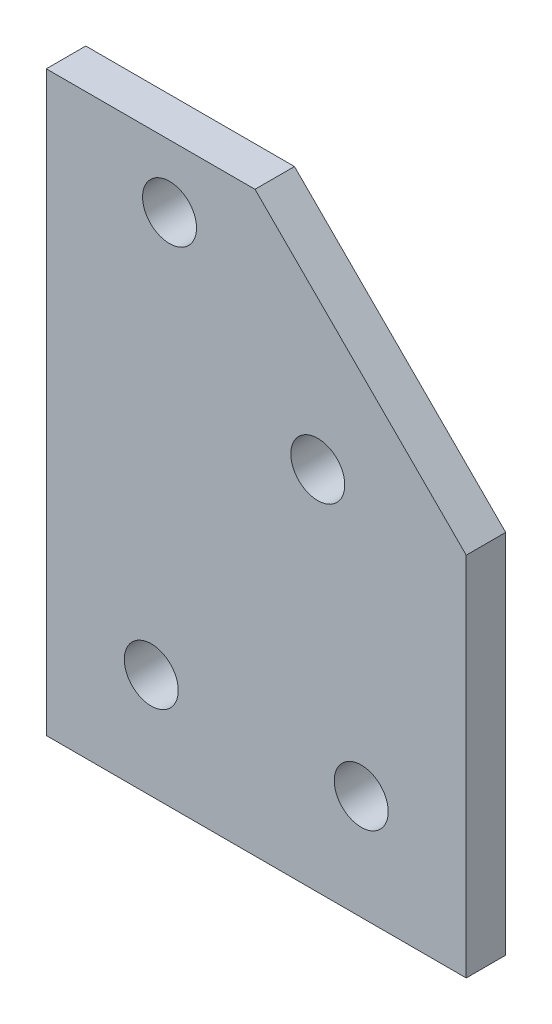
ISO-10303-21;
HEADER;
FILE_DESCRIPTION(('STEP AP214'),'2;1');
FILE_NAME('part.step','',(''),(''),'','','');
FILE_SCHEMA(('AUTOMOTIVE_DESIGN { 1 0 10303 214 1 1 1 1 }'));
ENDSEC;
DATA;
#1=APPLICATION_CONTEXT('core data for automotive mechanical design processes');
#2=APPLICATION_PROTOCOL_DEFINITION('international standard','automotive_design',2000,#1);
#3=PRODUCT_CONTEXT('',#1,'mechanical');
#4=PRODUCT('Part','Part','',(#3));
#5=PRODUCT_RELATED_PRODUCT_CATEGORY('part','',(#4));
#6=PRODUCT_DEFINITION_FORMATION('','',#4);
#7=PRODUCT_DEFINITION_CONTEXT('part definition',#1,'design');
#8=PRODUCT_DEFINITION('design','',#6,#7);
#9=PRODUCT_DEFINITION_SHAPE('','',#8);
#10=(LENGTH_UNIT() NAMED_UNIT(*) SI_UNIT(.MILLI.,.METRE.));
#11=(NAMED_UNIT(*) PLANE_ANGLE_UNIT() SI_UNIT($,.RADIAN.));
#12=(NAMED_UNIT(*) SI_UNIT($,.STERADIAN.) SOLID_ANGLE_UNIT());
#13=UNCERTAINTY_MEASURE_WITH_UNIT(LENGTH_MEASURE(1.E-05),#10,'distance_accuracy_value','');
#14=(GEOMETRIC_REPRESENTATION_CONTEXT(3) GLOBAL_UNCERTAINTY_ASSIGNED_CONTEXT((#13)) GLOBAL_UNIT_ASSIGNED_CONTEXT((#10,
#11,#12)) REPRESENTATION_CONTEXT('',''));
#15=CARTESIAN_POINT('',(0.,0.,0.));
#16=DIRECTION('',(0.,0.,1.));
#17=DIRECTION('',(1.,0.,0.));
#18=AXIS2_PLACEMENT_3D('',#15,#16,#17);
#19=CARTESIAN_POINT('',(-25.4,-34.925,2.3876));
#20=DIRECTION('',(0.,0.,-1.));
#21=DIRECTION('',(0.,1.,0.));
#22=AXIS2_PLACEMENT_3D('',#19,#20,#21);
#23=PLANE('',#22);
#24=DIRECTION('',(0.707106781186548,-0.707106781186548,0.));
#25=VECTOR('',#24,1.);
#26=CARTESIAN_POINT('',(-0.15239999999999,34.925,2.3876));
#27=LINE('',#26,#25);
#28=CARTESIAN_POINT('',(25.4,9.37259999999999,2.3876));
#29=VERTEX_POINT('',#28);
#30=CARTESIAN_POINT('',(-0.15239999999999,34.925,2.3876));
#31=VERTEX_POINT('',#30);
#32=EDGE_CURVE('E371',#29,#31,#27,.F.);
#33=ORIENTED_EDGE('',*,*,#32,.T.);
#34=DIRECTION('',(-1.,0.,0.));
#35=VECTOR('',#34,1.);
#36=CARTESIAN_POINT('',(25.4,34.925,2.3876));
#37=LINE('',#36,#35);
#38=CARTESIAN_POINT('',(-25.4,34.925,2.3876));
#39=VERTEX_POINT('',#38);
#40=EDGE_CURVE('E65',#39,#31,#37,.F.);
#41=ORIENTED_EDGE('',*,*,#40,.F.);
#42=DIRECTION('',(0.,1.,0.));
#43=VECTOR('',#42,1.);
#44=CARTESIAN_POINT('',(-25.4,-34.925,2.3876));
#45=LINE('',#44,#43);
#46=CARTESIAN_POINT('',(-25.4,-34.925,2.3876));
#47=VERTEX_POINT('',#46);
#48=EDGE_CURVE('E63',#39,#47,#45,.F.);
#49=ORIENTED_EDGE('',*,*,#48,.T.);
#50=DIRECTION('',(-1.,0.,0.));
#51=VECTOR('',#50,1.);
#52=CARTESIAN_POINT('',(25.4,-34.925,2.3876));
#53=LINE('',#52,#51);
#54=CARTESIAN_POINT('',(25.4,-34.925,2.3876));
#55=VERTEX_POINT('',#54);
#56=EDGE_CURVE('E60',#47,#55,#53,.F.);
#57=ORIENTED_EDGE('',*,*,#56,.T.);
#58=DIRECTION('',(0.,-1.,0.));
#59=VECTOR('',#58,1.);
#60=CARTESIAN_POINT('',(25.4,-34.925,2.3876));
#61=LINE('',#60,#59);
#62=EDGE_CURVE('E366',#55,#29,#61,.F.);
#63=ORIENTED_EDGE('',*,*,#62,.T.);
#64=EDGE_LOOP('',(#33,#41,#49,#57,#63));
#65=FACE_BOUND('',#64,.T.);
#66=CARTESIAN_POINT('',(-10.4902,27.3304,2.3876));
#67=DIRECTION('',(0.,0.,1.));
#68=DIRECTION('',(0.,-1.,0.));
#69=AXIS2_PLACEMENT_3D('',#66,#67,#68);
#70=CIRCLE('',#69,3.2639);
#71=CARTESIAN_POINT('',(-10.4902,24.0665,2.3876));
#72=VERTEX_POINT('',#71);
#73=EDGE_CURVE('E71',#72,#72,#70,.F.);
#74=ORIENTED_EDGE('',*,*,#73,.T.);
#75=EDGE_LOOP('',(#74));
#76=FACE_BOUND('',#75,.T.);
#77=CARTESIAN_POINT('',(-12.7,-22.225,2.3876));
#78=DIRECTION('',(0.,0.,1.));
#79=DIRECTION('',(0.,-1.,0.));
#80=AXIS2_PLACEMENT_3D('',#77,#78,#79);
#81=CIRCLE('',#80,3.2639);
#82=CARTESIAN_POINT('',(-12.7,-25.4889,2.3876));
#83=VERTEX_POINT('',#82);
#84=EDGE_CURVE('E100',#83,#83,#81,.F.);
#85=ORIENTED_EDGE('',*,*,#84,.T.);
#86=EDGE_LOOP('',(#85));
#87=FACE_BOUND('',#86,.T.);
#88=CARTESIAN_POINT('',(7.44220000000001,9.37259999999999,2.3876));
#89=DIRECTION('',(0.,0.,1.));
#90=DIRECTION('',(0.,-1.,0.));
#91=AXIS2_PLACEMENT_3D('',#88,#89,#90);
#92=CIRCLE('',#91,3.2639);
#93=CARTESIAN_POINT('',(7.44220000000001,6.10869999999999,2.3876));
#94=VERTEX_POINT('',#93);
#95=EDGE_CURVE('E102',#94,#94,#92,.F.);
#96=ORIENTED_EDGE('',*,*,#95,.T.);
#97=EDGE_LOOP('',(#96));
#98=FACE_BOUND('',#97,.T.);
#99=CARTESIAN_POINT('',(12.7,-22.225,2.3876));
#100=DIRECTION('',(0.,0.,1.));
#101=DIRECTION('',(0.,-1.,0.));
#102=AXIS2_PLACEMENT_3D('',#99,#100,#101);
#103=CIRCLE('',#102,3.26390000000001);
#104=CARTESIAN_POINT('',(12.7,-25.4889,2.3876));
#105=VERTEX_POINT('',#104);
#106=EDGE_CURVE('E19',#105,#105,#103,.F.);
#107=ORIENTED_EDGE('',*,*,#106,.T.);
#108=EDGE_LOOP('',(#107));
#109=FACE_BOUND('',#108,.T.);
#110=ADVANCED_FACE('F16',(#65,#76,#87,#98,#109),#23,.F.);
#111=CARTESIAN_POINT('',(12.7,-22.225,-2.3876));
#112=DIRECTION('',(0.,0.,1.));
#113=DIRECTION('',(0.,-1.,0.));
#114=AXIS2_PLACEMENT_3D('',#111,#112,#113);
#115=CYLINDRICAL_SURFACE('',#114,3.26390000000001);
#116=CARTESIAN_POINT('',(12.7,-22.225,-2.3876));
#117=DIRECTION('',(0.,0.,1.));
#118=DIRECTION('',(0.,-1.,0.));
#119=AXIS2_PLACEMENT_3D('',#116,#117,#118);
#120=CIRCLE('',#119,3.26390000000001);
#121=CARTESIAN_POINT('',(12.7,-25.4889,-2.3876));
#122=VERTEX_POINT('',#121);
#123=EDGE_CURVE('E95',#122,#122,#120,.F.);
#124=ORIENTED_EDGE('',*,*,#123,.T.);
#125=EDGE_LOOP('',(#124));
#126=FACE_BOUND('',#125,.T.);
#127=ORIENTED_EDGE('',*,*,#106,.F.);
#128=EDGE_LOOP('',(#127));
#129=FACE_BOUND('',#128,.T.);
#130=ADVANCED_FACE('F110',(#126,#129),#115,.F.);
#131=CARTESIAN_POINT('',(7.44220000000001,9.37259999999999,-2.3876));
#132=DIRECTION('',(0.,0.,1.));
#133=DIRECTION('',(0.,-1.,0.));
#134=AXIS2_PLACEMENT_3D('',#131,#132,#133);
#135=CYLINDRICAL_SURFACE('',#134,3.2639);
#136=CARTESIAN_POINT('',(7.44220000000001,9.37259999999999,-2.3876));
#137=DIRECTION('',(0.,0.,1.));
#138=DIRECTION('',(0.,-1.,0.));
#139=AXIS2_PLACEMENT_3D('',#136,#137,#138);
#140=CIRCLE('',#139,3.2639);
#141=CARTESIAN_POINT('',(7.44220000000001,6.10869999999999,-2.3876));
#142=VERTEX_POINT('',#141);
#143=EDGE_CURVE('E92',#142,#142,#140,.F.);
#144=ORIENTED_EDGE('',*,*,#143,.T.);
#145=EDGE_LOOP('',(#144));
#146=FACE_BOUND('',#145,.T.);
#147=ORIENTED_EDGE('',*,*,#95,.F.);
#148=EDGE_LOOP('',(#147));
#149=FACE_BOUND('',#148,.T.);
#150=ADVANCED_FACE('F112',(#146,#149),#135,.F.);
#151=CARTESIAN_POINT('',(-12.7,-22.225,-2.3876));
#152=DIRECTION('',(0.,0.,1.));
#153=DIRECTION('',(0.,-1.,0.));
#154=AXIS2_PLACEMENT_3D('',#151,#152,#153);
#155=CYLINDRICAL_SURFACE('',#154,3.2639);
#156=CARTESIAN_POINT('',(-12.7,-22.225,-2.3876));
#157=DIRECTION('',(0.,0.,1.));
#158=DIRECTION('',(0.,-1.,0.));
#159=AXIS2_PLACEMENT_3D('',#156,#157,#158);
#160=CIRCLE('',#159,3.2639);
#161=CARTESIAN_POINT('',(-12.7,-25.4889,-2.3876));
#162=VERTEX_POINT('',#161);
#163=EDGE_CURVE('E89',#162,#162,#160,.F.);
#164=ORIENTED_EDGE('',*,*,#163,.T.);
#165=EDGE_LOOP('',(#164));
#166=FACE_BOUND('',#165,.T.);
#167=ORIENTED_EDGE('',*,*,#84,.F.);
#168=EDGE_LOOP('',(#167));
#169=FACE_BOUND('',#168,.T.);
#170=ADVANCED_FACE('F120',(#166,#169),#155,.F.);
#171=CARTESIAN_POINT('',(-10.4902,27.3304,-2.3876));
#172=DIRECTION('',(0.,0.,1.));
#173=DIRECTION('',(0.,-1.,0.));
#174=AXIS2_PLACEMENT_3D('',#171,#172,#173);
#175=CYLINDRICAL_SURFACE('',#174,3.2639);
#176=CARTESIAN_POINT('',(-10.4902,27.3304,-2.3876));
#177=DIRECTION('',(0.,0.,1.));
#178=DIRECTION('',(0.,-1.,0.));
#179=AXIS2_PLACEMENT_3D('',#176,#177,#178);
#180=CIRCLE('',#179,3.2639);
#181=CARTESIAN_POINT('',(-10.4902,24.0665,-2.3876));
#182=VERTEX_POINT('',#181);
#183=EDGE_CURVE('E86',#182,#182,#180,.F.);
#184=ORIENTED_EDGE('',*,*,#183,.T.);
#185=EDGE_LOOP('',(#184));
#186=FACE_BOUND('',#185,.T.);
#187=ORIENTED_EDGE('',*,*,#73,.F.);
#188=EDGE_LOOP('',(#187));
#189=FACE_BOUND('',#188,.T.);
#190=ADVANCED_FACE('F148',(#186,#189),#175,.F.);
#191=CARTESIAN_POINT('',(-25.4,-34.925,-2.3876));
#192=DIRECTION('',(1.,0.,0.));
#193=DIRECTION('',(0.,1.,0.));
#194=AXIS2_PLACEMENT_3D('',#191,#192,#193);
#195=PLANE('',#194);
#196=DIRECTION('',(0.,-1.,0.));
#197=VECTOR('',#196,1.);
#198=CARTESIAN_POINT('',(-25.4,-34.925,-2.3876));
#199=LINE('',#198,#197);
#200=CARTESIAN_POINT('',(-25.4,34.925,-2.3876));
#201=VERTEX_POINT('',#200);
#202=CARTESIAN_POINT('',(-25.4,-34.925,-2.3876));
#203=VERTEX_POINT('',#202);
#204=EDGE_CURVE('E82',#201,#203,#199,.T.);
#205=ORIENTED_EDGE('',*,*,#204,.T.);
#206=DIRECTION('',(0.,0.,1.));
#207=VECTOR('',#206,1.);
#208=CARTESIAN_POINT('',(-25.4,-34.925,2.3876));
#209=LINE('',#208,#207);
#210=EDGE_CURVE('E70',#203,#47,#209,.T.);
#211=ORIENTED_EDGE('',*,*,#210,.T.);
#212=ORIENTED_EDGE('',*,*,#48,.F.);
#213=DIRECTION('',(0.,0.,1.));
#214=VECTOR('',#213,1.);
#215=CARTESIAN_POINT('',(-25.4,34.925,2.3876));
#216=LINE('',#215,#214);
#217=EDGE_CURVE('E377',#201,#39,#216,.T.);
#218=ORIENTED_EDGE('',*,*,#217,.F.);
#219=EDGE_LOOP('',(#205,#211,#212,#218));
#220=FACE_BOUND('',#219,.T.);
#221=ADVANCED_FACE('F81',(#220),#195,.F.);
#222=CARTESIAN_POINT('',(25.4,-34.925,2.3876));
#223=DIRECTION('',(0.,1.,0.));
#224=DIRECTION('',(-1.,0.,0.));
#225=AXIS2_PLACEMENT_3D('',#222,#223,#224);
#226=PLANE('',#225);
#227=ORIENTED_EDGE('',*,*,#56,.F.);
#228=ORIENTED_EDGE('',*,*,#210,.F.);
#229=DIRECTION('',(1.,0.,0.));
#230=VECTOR('',#229,1.);
#231=CARTESIAN_POINT('',(-25.4,-34.925,-2.3876));
#232=LINE('',#231,#230);
#233=CARTESIAN_POINT('',(25.4,-34.925,-2.3876));
#234=VERTEX_POINT('',#233);
#235=EDGE_CURVE('E381',#203,#234,#232,.T.);
#236=ORIENTED_EDGE('',*,*,#235,.T.);
#237=DIRECTION('',(0.,0.,1.));
#238=VECTOR('',#237,1.);
#239=CARTESIAN_POINT('',(25.4,-34.925,-2.3876));
#240=LINE('',#239,#238);
#241=EDGE_CURVE('E78',#234,#55,#240,.T.);
#242=ORIENTED_EDGE('',*,*,#241,.T.);
#243=EDGE_LOOP('',(#227,#228,#236,#242));
#244=FACE_BOUND('',#243,.T.);
#245=ADVANCED_FACE('F75',(#244),#226,.F.);
#246=CARTESIAN_POINT('',(25.4,-34.925,-2.3876));
#247=DIRECTION('',(-1.,0.,0.));
#248=DIRECTION('',(0.,-1.,0.));
#249=AXIS2_PLACEMENT_3D('',#246,#247,#248);
#250=PLANE('',#249);
#251=DIRECTION('',(0.,0.,1.));
#252=VECTOR('',#251,1.);
#253=CARTESIAN_POINT('',(25.4,9.37259999999999,-2.3876));
#254=LINE('',#253,#252);
#255=CARTESIAN_POINT('',(25.4,9.37259999999999,-2.3876));
#256=VERTEX_POINT('',#255);
#257=EDGE_CURVE('E365',#256,#29,#254,.T.);
#258=ORIENTED_EDGE('',*,*,#257,.T.);
#259=ORIENTED_EDGE('',*,*,#62,.F.);
#260=ORIENTED_EDGE('',*,*,#241,.F.);
#261=DIRECTION('',(0.,-1.,0.));
#262=VECTOR('',#261,1.);
#263=CARTESIAN_POINT('',(25.4,-34.925,-2.3876));
#264=LINE('',#263,#262);
#265=EDGE_CURVE('E368',#234,#256,#264,.F.);
#266=ORIENTED_EDGE('',*,*,#265,.T.);
#267=EDGE_LOOP('',(#258,#259,#260,#266));
#268=FACE_BOUND('',#267,.T.);
#269=ADVANCED_FACE('F139',(#268),#250,.F.);
#270=CARTESIAN_POINT('',(-0.15239999999999,34.925,-2.3876));
#271=DIRECTION('',(-0.707106781186548,-0.707106781186548,0.));
#272=DIRECTION('',(0.707106781186548,-0.707106781186548,0.));
#273=AXIS2_PLACEMENT_3D('',#270,#271,#272);
#274=PLANE('',#273);
#275=ORIENTED_EDGE('',*,*,#257,.F.);
#276=DIRECTION('',(-0.707106781186547,0.707106781186548,0.));
#277=VECTOR('',#276,1.);
#278=CARTESIAN_POINT('',(25.4,9.37259999999999,-2.3876));
#279=LINE('',#278,#277);
#280=CARTESIAN_POINT('',(-0.152399999999989,34.925,-2.3876));
#281=VERTEX_POINT('',#280);
#282=EDGE_CURVE('E25',#256,#281,#279,.T.);
#283=ORIENTED_EDGE('',*,*,#282,.T.);
#284=DIRECTION('',(0.,0.,1.));
#285=VECTOR('',#284,1.);
#286=CARTESIAN_POINT('',(-0.15239999999999,34.925,2.3876));
#287=LINE('',#286,#285);
#288=EDGE_CURVE('E33',#31,#281,#287,.F.);
#289=ORIENTED_EDGE('',*,*,#288,.F.);
#290=ORIENTED_EDGE('',*,*,#32,.F.);
#291=EDGE_LOOP('',(#275,#283,#289,#290));
#292=FACE_BOUND('',#291,.T.);
#293=ADVANCED_FACE('F132',(#292),#274,.F.);
#294=CARTESIAN_POINT('',(25.4,34.925,2.3876));
#295=DIRECTION('',(0.,1.,0.));
#296=DIRECTION('',(-1.,0.,0.));
#297=AXIS2_PLACEMENT_3D('',#294,#295,#296);
#298=PLANE('',#297);
#299=ORIENTED_EDGE('',*,*,#217,.T.);
#300=ORIENTED_EDGE('',*,*,#40,.T.);
#301=ORIENTED_EDGE('',*,*,#288,.T.);
#302=DIRECTION('',(1.,0.,0.));
#303=VECTOR('',#302,1.);
#304=CARTESIAN_POINT('',(-25.4,34.925,-2.3876));
#305=LINE('',#304,#303);
#306=EDGE_CURVE('E11',#281,#201,#305,.F.);
#307=ORIENTED_EDGE('',*,*,#306,.T.);
#308=EDGE_LOOP('',(#299,#300,#301,#307));
#309=FACE_BOUND('',#308,.T.);
#310=ADVANCED_FACE('F125',(#309),#298,.T.);
#311=CARTESIAN_POINT('',(-25.4,-34.925,-2.3876));
#312=DIRECTION('',(0.,0.,1.));
#313=DIRECTION('',(0.,-1.,0.));
#314=AXIS2_PLACEMENT_3D('',#311,#312,#313);
#315=PLANE('',#314);
#316=ORIENTED_EDGE('',*,*,#282,.F.);
#317=ORIENTED_EDGE('',*,*,#265,.F.);
#318=ORIENTED_EDGE('',*,*,#235,.F.);
#319=ORIENTED_EDGE('',*,*,#204,.F.);
#320=ORIENTED_EDGE('',*,*,#306,.F.);
#321=EDGE_LOOP('',(#316,#317,#318,#319,#320));
#322=FACE_BOUND('',#321,.T.);
#323=ORIENTED_EDGE('',*,*,#183,.F.);
#324=EDGE_LOOP('',(#323));
#325=FACE_BOUND('',#324,.T.);
#326=ORIENTED_EDGE('',*,*,#163,.F.);
#327=EDGE_LOOP('',(#326));
#328=FACE_BOUND('',#327,.T.);
#329=ORIENTED_EDGE('',*,*,#143,.F.);
#330=EDGE_LOOP('',(#329));
#331=FACE_BOUND('',#330,.T.);
#332=ORIENTED_EDGE('',*,*,#123,.F.);
#333=EDGE_LOOP('',(#332));
#334=FACE_BOUND('',#333,.T.);
#335=ADVANCED_FACE('F123',(#322,#325,#328,#331,#334),#315,.F.);
#336=CLOSED_SHELL('',(#110,#130,#150,#170,#190,#221,#245,#269,#293,#310,#335));
#337=MANIFOLD_SOLID_BREP('B1',#336);
#338=ADVANCED_BREP_SHAPE_REPRESENTATION('',(#18,#337),#14);
#339=SHAPE_DEFINITION_REPRESENTATION(#9,#338);
ENDSEC;
END-ISO-10303-21;
